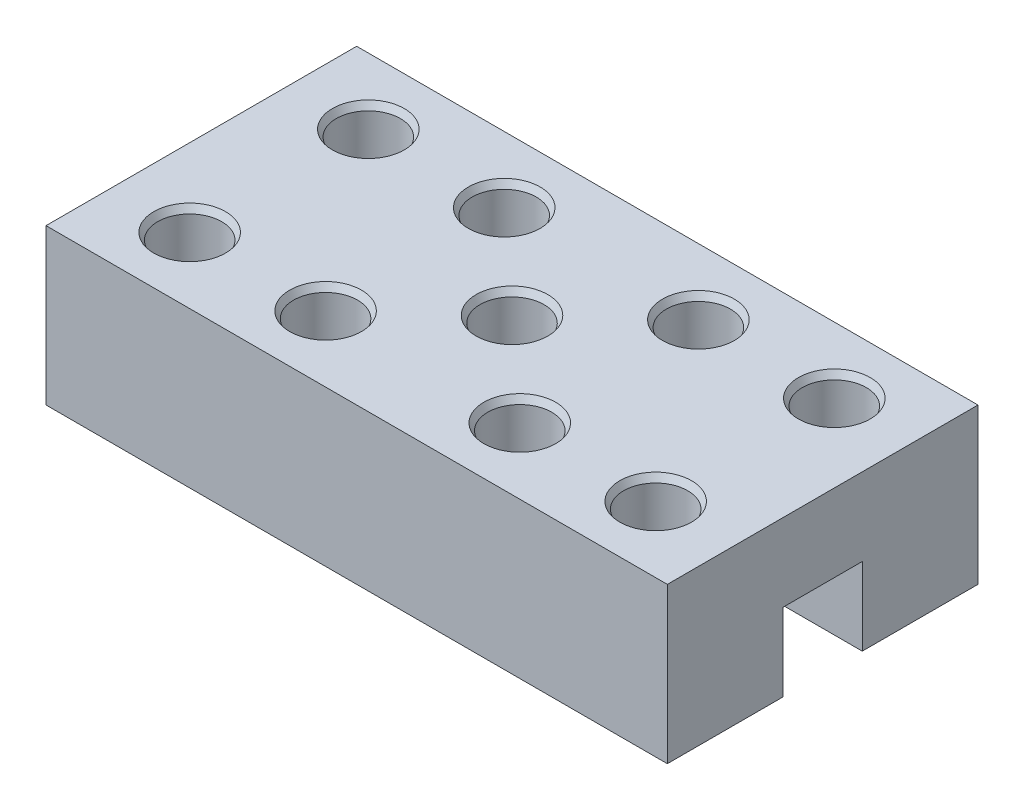
ISO-10303-21;
HEADER;
FILE_DESCRIPTION(('STEP AP214'),'2;1');
FILE_NAME('part.step','',(''),(''),'','','');
FILE_SCHEMA(('AUTOMOTIVE_DESIGN { 1 0 10303 214 1 1 1 1 }'));
ENDSEC;
DATA;
#1=APPLICATION_CONTEXT('core data for automotive mechanical design processes');
#2=APPLICATION_PROTOCOL_DEFINITION('international standard','automotive_design',2000,#1);
#3=PRODUCT_CONTEXT('',#1,'mechanical');
#4=PRODUCT('Part','Part','',(#3));
#5=PRODUCT_RELATED_PRODUCT_CATEGORY('part','',(#4));
#6=PRODUCT_DEFINITION_FORMATION('','',#4);
#7=PRODUCT_DEFINITION_CONTEXT('part definition',#1,'design');
#8=PRODUCT_DEFINITION('design','',#6,#7);
#9=PRODUCT_DEFINITION_SHAPE('','',#8);
#10=(LENGTH_UNIT() NAMED_UNIT(*) SI_UNIT(.MILLI.,.METRE.));
#11=(NAMED_UNIT(*) PLANE_ANGLE_UNIT() SI_UNIT($,.RADIAN.));
#12=(NAMED_UNIT(*) SI_UNIT($,.STERADIAN.) SOLID_ANGLE_UNIT());
#13=UNCERTAINTY_MEASURE_WITH_UNIT(LENGTH_MEASURE(1.E-05),#10,'distance_accuracy_value','');
#14=(GEOMETRIC_REPRESENTATION_CONTEXT(3) GLOBAL_UNCERTAINTY_ASSIGNED_CONTEXT((#13)) GLOBAL_UNIT_ASSIGNED_CONTEXT((#10,
#11,#12)) REPRESENTATION_CONTEXT('',''));
#15=CARTESIAN_POINT('',(0.,0.,0.));
#16=DIRECTION('',(0.,0.,1.));
#17=DIRECTION('',(1.,0.,0.));
#18=AXIS2_PLACEMENT_3D('',#15,#16,#17);
#19=CARTESIAN_POINT('',(0.,0.,0.));
#20=DIRECTION('',(0.,1.,0.));
#21=DIRECTION('',(0.,0.,1.));
#22=AXIS2_PLACEMENT_3D('',#19,#20,#21);
#23=PLANE('',#22);
#24=CARTESIAN_POINT('',(30.,0.,-11.5));
#25=DIRECTION('',(0.,1.,0.));
#26=DIRECTION('',(0.,0.,1.));
#27=AXIS2_PLACEMENT_3D('',#24,#25,#26);
#28=CIRCLE('',#27,4.125);
#29=CARTESIAN_POINT('',(30.,0.,-7.37500000000001));
#30=VERTEX_POINT('',#29);
#31=EDGE_CURVE('E345',#30,#30,#28,.T.);
#32=ORIENTED_EDGE('',*,*,#31,.T.);
#33=EDGE_LOOP('',(#32));
#34=FACE_BOUND('',#33,.T.);
#35=CARTESIAN_POINT('',(-30.,0.,-11.5));
#36=DIRECTION('',(0.,1.,0.));
#37=DIRECTION('',(0.,0.,1.));
#38=AXIS2_PLACEMENT_3D('',#35,#36,#37);
#39=CIRCLE('',#38,4.125);
#40=CARTESIAN_POINT('',(-30.,0.,-7.37500000000001));
#41=VERTEX_POINT('',#40);
#42=EDGE_CURVE('E340',#41,#41,#39,.T.);
#43=ORIENTED_EDGE('',*,*,#42,.T.);
#44=EDGE_LOOP('',(#43));
#45=FACE_BOUND('',#44,.T.);
#46=CARTESIAN_POINT('',(12.5,0.,-11.5));
#47=DIRECTION('',(0.,1.,0.));
#48=DIRECTION('',(0.,0.,1.));
#49=AXIS2_PLACEMENT_3D('',#46,#47,#48);
#50=CIRCLE('',#49,4.125);
#51=CARTESIAN_POINT('',(12.5,0.,-7.375));
#52=VERTEX_POINT('',#51);
#53=EDGE_CURVE('E342',#52,#52,#50,.T.);
#54=ORIENTED_EDGE('',*,*,#53,.T.);
#55=EDGE_LOOP('',(#54));
#56=FACE_BOUND('',#55,.T.);
#57=CARTESIAN_POINT('',(-12.5,0.,-11.5));
#58=DIRECTION('',(0.,1.,0.));
#59=DIRECTION('',(0.,0.,1.));
#60=AXIS2_PLACEMENT_3D('',#57,#58,#59);
#61=CIRCLE('',#60,4.125);
#62=CARTESIAN_POINT('',(-12.5,0.,-7.375));
#63=VERTEX_POINT('',#62);
#64=EDGE_CURVE('E350',#63,#63,#61,.T.);
#65=ORIENTED_EDGE('',*,*,#64,.T.);
#66=EDGE_LOOP('',(#65));
#67=FACE_BOUND('',#66,.T.);
#68=DIRECTION('',(0.,0.,-1.));
#69=VECTOR('',#68,1.);
#70=CARTESIAN_POINT('',(40.,0.,20.));
#71=LINE('',#70,#69);
#72=CARTESIAN_POINT('',(40.,0.,-5.1));
#73=VERTEX_POINT('',#72);
#74=CARTESIAN_POINT('',(40.,0.,-20.));
#75=VERTEX_POINT('',#74);
#76=EDGE_CURVE('E162',#73,#75,#71,.T.);
#77=ORIENTED_EDGE('',*,*,#76,.F.);
#78=DIRECTION('',(-1.,0.,0.));
#79=VECTOR('',#78,1.);
#80=CARTESIAN_POINT('',(0.,0.,-5.1));
#81=LINE('',#80,#79);
#82=CARTESIAN_POINT('',(-40.,0.,-5.1));
#83=VERTEX_POINT('',#82);
#84=EDGE_CURVE('E174',#73,#83,#81,.T.);
#85=ORIENTED_EDGE('',*,*,#84,.T.);
#86=DIRECTION('',(0.,0.,1.));
#87=VECTOR('',#86,1.);
#88=CARTESIAN_POINT('',(-40.,0.,20.));
#89=LINE('',#88,#87);
#90=CARTESIAN_POINT('',(-40.,0.,-20.));
#91=VERTEX_POINT('',#90);
#92=EDGE_CURVE('E157',#91,#83,#89,.T.);
#93=ORIENTED_EDGE('',*,*,#92,.F.);
#94=DIRECTION('',(-1.,0.,0.));
#95=VECTOR('',#94,1.);
#96=CARTESIAN_POINT('',(40.,0.,-20.));
#97=LINE('',#96,#95);
#98=EDGE_CURVE('E86',#75,#91,#97,.T.);
#99=ORIENTED_EDGE('',*,*,#98,.F.);
#100=EDGE_LOOP('',(#77,#85,#93,#99));
#101=FACE_BOUND('',#100,.T.);
#102=ADVANCED_FACE('F41',(#34,#45,#56,#67,#101),#23,.F.);
#103=CARTESIAN_POINT('',(-40.,20.,20.));
#104=DIRECTION('',(1.,0.,0.));
#105=DIRECTION('',(0.,0.,-1.));
#106=AXIS2_PLACEMENT_3D('',#103,#104,#105);
#107=PLANE('',#106);
#108=ORIENTED_EDGE('',*,*,#92,.T.);
#109=DIRECTION('',(0.,-1.,0.));
#110=VECTOR('',#109,1.);
#111=CARTESIAN_POINT('',(-40.,-10.,-5.1));
#112=LINE('',#111,#110);
#113=CARTESIAN_POINT('',(-40.,10.,-5.1));
#114=VERTEX_POINT('',#113);
#115=EDGE_CURVE('E142',#114,#83,#112,.T.);
#116=ORIENTED_EDGE('',*,*,#115,.F.);
#117=DIRECTION('',(0.,0.,-1.));
#118=VECTOR('',#117,1.);
#119=CARTESIAN_POINT('',(-40.,10.,5.1));
#120=LINE('',#119,#118);
#121=CARTESIAN_POINT('',(-40.,10.,5.1));
#122=VERTEX_POINT('',#121);
#123=EDGE_CURVE('E138',#122,#114,#120,.T.);
#124=ORIENTED_EDGE('',*,*,#123,.F.);
#125=DIRECTION('',(0.,1.,0.));
#126=VECTOR('',#125,1.);
#127=CARTESIAN_POINT('',(-40.,-10.,5.1));
#128=LINE('',#127,#126);
#129=CARTESIAN_POINT('',(-40.,0.,5.1));
#130=VERTEX_POINT('',#129);
#131=EDGE_CURVE('E118',#130,#122,#128,.T.);
#132=ORIENTED_EDGE('',*,*,#131,.F.);
#133=CARTESIAN_POINT('',(-40.,0.,20.));
#134=VERTEX_POINT('',#133);
#135=EDGE_CURVE('E147',#130,#134,#89,.T.);
#136=ORIENTED_EDGE('',*,*,#135,.T.);
#137=DIRECTION('',(0.,-1.,0.));
#138=VECTOR('',#137,1.);
#139=CARTESIAN_POINT('',(-40.,20.,20.));
#140=LINE('',#139,#138);
#141=CARTESIAN_POINT('',(-40.,20.,20.));
#142=VERTEX_POINT('',#141);
#143=EDGE_CURVE('E170',#142,#134,#140,.T.);
#144=ORIENTED_EDGE('',*,*,#143,.F.);
#145=DIRECTION('',(0.,0.,1.));
#146=VECTOR('',#145,1.);
#147=CARTESIAN_POINT('',(-40.,20.,20.));
#148=LINE('',#147,#146);
#149=CARTESIAN_POINT('',(-40.,20.,-20.));
#150=VERTEX_POINT('',#149);
#151=EDGE_CURVE('E149',#150,#142,#148,.T.);
#152=ORIENTED_EDGE('',*,*,#151,.F.);
#153=DIRECTION('',(0.,-1.,0.));
#154=VECTOR('',#153,1.);
#155=CARTESIAN_POINT('',(-40.,20.,-20.));
#156=LINE('',#155,#154);
#157=EDGE_CURVE('E156',#150,#91,#156,.T.);
#158=ORIENTED_EDGE('',*,*,#157,.T.);
#159=EDGE_LOOP('',(#108,#116,#124,#132,#136,#144,#152,#158));
#160=FACE_BOUND('',#159,.T.);
#161=ADVANCED_FACE('F248',(#160),#107,.F.);
#162=CARTESIAN_POINT('',(40.,20.,20.));
#163=DIRECTION('',(0.,0.,-1.));
#164=DIRECTION('',(-1.,0.,0.));
#165=AXIS2_PLACEMENT_3D('',#162,#163,#164);
#166=PLANE('',#165);
#167=DIRECTION('',(1.,0.,0.));
#168=VECTOR('',#167,1.);
#169=CARTESIAN_POINT('',(40.,0.,20.));
#170=LINE('',#169,#168);
#171=CARTESIAN_POINT('',(40.,0.,20.));
#172=VERTEX_POINT('',#171);
#173=EDGE_CURVE('E160',#134,#172,#170,.T.);
#174=ORIENTED_EDGE('',*,*,#173,.T.);
#175=DIRECTION('',(0.,-1.,0.));
#176=VECTOR('',#175,1.);
#177=CARTESIAN_POINT('',(40.,20.,20.));
#178=LINE('',#177,#176);
#179=CARTESIAN_POINT('',(40.,20.,20.));
#180=VERTEX_POINT('',#179);
#181=EDGE_CURVE('E168',#180,#172,#178,.T.);
#182=ORIENTED_EDGE('',*,*,#181,.F.);
#183=DIRECTION('',(1.,0.,0.));
#184=VECTOR('',#183,1.);
#185=CARTESIAN_POINT('',(40.,20.,20.));
#186=LINE('',#185,#184);
#187=EDGE_CURVE('E94',#142,#180,#186,.T.);
#188=ORIENTED_EDGE('',*,*,#187,.F.);
#189=ORIENTED_EDGE('',*,*,#143,.T.);
#190=EDGE_LOOP('',(#174,#182,#188,#189));
#191=FACE_BOUND('',#190,.T.);
#192=ADVANCED_FACE('F255',(#191),#166,.F.);
#193=CARTESIAN_POINT('',(40.,20.,20.));
#194=DIRECTION('',(-1.,0.,0.));
#195=DIRECTION('',(0.,0.,1.));
#196=AXIS2_PLACEMENT_3D('',#193,#194,#195);
#197=PLANE('',#196);
#198=DIRECTION('',(0.,0.,-1.));
#199=VECTOR('',#198,1.);
#200=CARTESIAN_POINT('',(40.,10.,5.1));
#201=LINE('',#200,#199);
#202=CARTESIAN_POINT('',(40.,10.,5.1));
#203=VERTEX_POINT('',#202);
#204=CARTESIAN_POINT('',(40.,10.,-5.1));
#205=VERTEX_POINT('',#204);
#206=EDGE_CURVE('E123',#203,#205,#201,.T.);
#207=ORIENTED_EDGE('',*,*,#206,.T.);
#208=DIRECTION('',(0.,-1.,0.));
#209=VECTOR('',#208,1.);
#210=CARTESIAN_POINT('',(40.,-10.,-5.1));
#211=LINE('',#210,#209);
#212=EDGE_CURVE('E136',#205,#73,#211,.T.);
#213=ORIENTED_EDGE('',*,*,#212,.T.);
#214=ORIENTED_EDGE('',*,*,#76,.T.);
#215=DIRECTION('',(0.,-1.,0.));
#216=VECTOR('',#215,1.);
#217=CARTESIAN_POINT('',(40.,20.,-20.));
#218=LINE('',#217,#216);
#219=CARTESIAN_POINT('',(40.,20.,-20.));
#220=VERTEX_POINT('',#219);
#221=EDGE_CURVE('E166',#220,#75,#218,.T.);
#222=ORIENTED_EDGE('',*,*,#221,.F.);
#223=DIRECTION('',(0.,0.,-1.));
#224=VECTOR('',#223,1.);
#225=CARTESIAN_POINT('',(40.,20.,20.));
#226=LINE('',#225,#224);
#227=EDGE_CURVE('E153',#180,#220,#226,.T.);
#228=ORIENTED_EDGE('',*,*,#227,.F.);
#229=ORIENTED_EDGE('',*,*,#181,.T.);
#230=CARTESIAN_POINT('',(40.,0.,5.1));
#231=VERTEX_POINT('',#230);
#232=EDGE_CURVE('E135',#172,#231,#71,.T.);
#233=ORIENTED_EDGE('',*,*,#232,.T.);
#234=DIRECTION('',(0.,1.,0.));
#235=VECTOR('',#234,1.);
#236=CARTESIAN_POINT('',(40.,-10.,5.1));
#237=LINE('',#236,#235);
#238=EDGE_CURVE('E56',#231,#203,#237,.T.);
#239=ORIENTED_EDGE('',*,*,#238,.T.);
#240=EDGE_LOOP('',(#207,#213,#214,#222,#228,#229,#233,#239));
#241=FACE_BOUND('',#240,.T.);
#242=ADVANCED_FACE('F132',(#241),#197,.F.);
#243=CARTESIAN_POINT('',(40.,20.,-20.));
#244=DIRECTION('',(0.,0.,1.));
#245=DIRECTION('',(1.,0.,0.));
#246=AXIS2_PLACEMENT_3D('',#243,#244,#245);
#247=PLANE('',#246);
#248=ORIENTED_EDGE('',*,*,#98,.T.);
#249=ORIENTED_EDGE('',*,*,#157,.F.);
#250=DIRECTION('',(-1.,0.,0.));
#251=VECTOR('',#250,1.);
#252=CARTESIAN_POINT('',(40.,20.,-20.));
#253=LINE('',#252,#251);
#254=EDGE_CURVE('E65',#220,#150,#253,.T.);
#255=ORIENTED_EDGE('',*,*,#254,.F.);
#256=ORIENTED_EDGE('',*,*,#221,.T.);
#257=EDGE_LOOP('',(#248,#249,#255,#256));
#258=FACE_BOUND('',#257,.T.);
#259=ADVANCED_FACE('F272',(#258),#247,.F.);
#260=CARTESIAN_POINT('',(0.,20.,0.));
#261=DIRECTION('',(0.,1.,0.));
#262=DIRECTION('',(0.,0.,1.));
#263=AXIS2_PLACEMENT_3D('',#260,#261,#262);
#264=PLANE('',#263);
#265=CARTESIAN_POINT('',(30.,20.,-11.5));
#266=DIRECTION('',(0.,1.,0.));
#267=DIRECTION('',(0.,0.,1.));
#268=AXIS2_PLACEMENT_3D('',#265,#266,#267);
#269=CIRCLE('',#268,4.62500000000003);
#270=CARTESIAN_POINT('',(30.,20.,-6.87499999999998));
#271=VERTEX_POINT('',#270);
#272=EDGE_CURVE('E208',#271,#271,#269,.F.);
#273=ORIENTED_EDGE('',*,*,#272,.T.);
#274=EDGE_LOOP('',(#273));
#275=FACE_BOUND('',#274,.T.);
#276=CARTESIAN_POINT('',(12.5,20.,-11.5));
#277=DIRECTION('',(0.,1.,0.));
#278=DIRECTION('',(0.,0.,1.));
#279=AXIS2_PLACEMENT_3D('',#276,#277,#278);
#280=CIRCLE('',#279,4.62500000000003);
#281=CARTESIAN_POINT('',(12.5,20.,-6.87499999999998));
#282=VERTEX_POINT('',#281);
#283=EDGE_CURVE('E205',#282,#282,#280,.F.);
#284=ORIENTED_EDGE('',*,*,#283,.T.);
#285=EDGE_LOOP('',(#284));
#286=FACE_BOUND('',#285,.T.);
#287=CARTESIAN_POINT('',(0.,20.,0.));
#288=DIRECTION('',(0.,1.,0.));
#289=DIRECTION('',(0.,0.,1.));
#290=AXIS2_PLACEMENT_3D('',#287,#288,#289);
#291=CIRCLE('',#290,4.62500000000002);
#292=CARTESIAN_POINT('',(0.,20.,4.62500000000002));
#293=VERTEX_POINT('',#292);
#294=EDGE_CURVE('E202',#293,#293,#291,.F.);
#295=ORIENTED_EDGE('',*,*,#294,.T.);
#296=EDGE_LOOP('',(#295));
#297=FACE_BOUND('',#296,.T.);
#298=CARTESIAN_POINT('',(-12.5,20.,-11.5));
#299=DIRECTION('',(0.,1.,0.));
#300=DIRECTION('',(0.,0.,1.));
#301=AXIS2_PLACEMENT_3D('',#298,#299,#300);
#302=CIRCLE('',#301,4.625);
#303=CARTESIAN_POINT('',(-12.5,20.,-6.875));
#304=VERTEX_POINT('',#303);
#305=EDGE_CURVE('E199',#304,#304,#302,.F.);
#306=ORIENTED_EDGE('',*,*,#305,.T.);
#307=EDGE_LOOP('',(#306));
#308=FACE_BOUND('',#307,.T.);
#309=CARTESIAN_POINT('',(-30.,20.,-11.5));
#310=DIRECTION('',(0.,1.,0.));
#311=DIRECTION('',(0.,0.,1.));
#312=AXIS2_PLACEMENT_3D('',#309,#310,#311);
#313=CIRCLE('',#312,4.62500000000003);
#314=CARTESIAN_POINT('',(-30.,20.,-6.87499999999998));
#315=VERTEX_POINT('',#314);
#316=EDGE_CURVE('E196',#315,#315,#313,.F.);
#317=ORIENTED_EDGE('',*,*,#316,.T.);
#318=EDGE_LOOP('',(#317));
#319=FACE_BOUND('',#318,.T.);
#320=CARTESIAN_POINT('',(-30.,20.,11.5));
#321=DIRECTION('',(0.,1.,0.));
#322=DIRECTION('',(0.,0.,1.));
#323=AXIS2_PLACEMENT_3D('',#320,#321,#322);
#324=CIRCLE('',#323,4.625);
#325=CARTESIAN_POINT('',(-30.,20.,16.125));
#326=VERTEX_POINT('',#325);
#327=EDGE_CURVE('E193',#326,#326,#324,.F.);
#328=ORIENTED_EDGE('',*,*,#327,.T.);
#329=EDGE_LOOP('',(#328));
#330=FACE_BOUND('',#329,.T.);
#331=CARTESIAN_POINT('',(-12.5,20.,11.5));
#332=DIRECTION('',(0.,1.,0.));
#333=DIRECTION('',(0.,0.,1.));
#334=AXIS2_PLACEMENT_3D('',#331,#332,#333);
#335=CIRCLE('',#334,4.625);
#336=CARTESIAN_POINT('',(-12.5,20.,16.125));
#337=VERTEX_POINT('',#336);
#338=EDGE_CURVE('E190',#337,#337,#335,.F.);
#339=ORIENTED_EDGE('',*,*,#338,.T.);
#340=EDGE_LOOP('',(#339));
#341=FACE_BOUND('',#340,.T.);
#342=CARTESIAN_POINT('',(12.5,20.,11.5));
#343=DIRECTION('',(0.,1.,0.));
#344=DIRECTION('',(0.,0.,1.));
#345=AXIS2_PLACEMENT_3D('',#342,#343,#344);
#346=CIRCLE('',#345,4.625);
#347=CARTESIAN_POINT('',(12.5,20.,16.125));
#348=VERTEX_POINT('',#347);
#349=EDGE_CURVE('E187',#348,#348,#346,.F.);
#350=ORIENTED_EDGE('',*,*,#349,.T.);
#351=EDGE_LOOP('',(#350));
#352=FACE_BOUND('',#351,.T.);
#353=CARTESIAN_POINT('',(30.,20.,11.5));
#354=DIRECTION('',(0.,1.,0.));
#355=DIRECTION('',(0.,0.,1.));
#356=AXIS2_PLACEMENT_3D('',#353,#354,#355);
#357=CIRCLE('',#356,4.62500000000002);
#358=CARTESIAN_POINT('',(30.,20.,16.125));
#359=VERTEX_POINT('',#358);
#360=EDGE_CURVE('E184',#359,#359,#357,.F.);
#361=ORIENTED_EDGE('',*,*,#360,.T.);
#362=EDGE_LOOP('',(#361));
#363=FACE_BOUND('',#362,.T.);
#364=ORIENTED_EDGE('',*,*,#151,.T.);
#365=ORIENTED_EDGE('',*,*,#187,.T.);
#366=ORIENTED_EDGE('',*,*,#227,.T.);
#367=ORIENTED_EDGE('',*,*,#254,.T.);
#368=EDGE_LOOP('',(#364,#365,#366,#367));
#369=FACE_BOUND('',#368,.T.);
#370=ADVANCED_FACE('F264',(#275,#286,#297,#308,#319,#330,#341,#352,#363,#369),#264,.T.);
#371=CARTESIAN_POINT('',(-30.,0.,11.5));
#372=DIRECTION('',(0.,1.,0.));
#373=DIRECTION('',(0.,0.,1.));
#374=AXIS2_PLACEMENT_3D('',#371,#372,#373);
#375=CIRCLE('',#374,4.125);
#376=CARTESIAN_POINT('',(-30.,0.,15.625));
#377=VERTEX_POINT('',#376);
#378=EDGE_CURVE('E277',#377,#377,#375,.T.);
#379=ORIENTED_EDGE('',*,*,#378,.T.);
#380=EDGE_LOOP('',(#379));
#381=FACE_BOUND('',#380,.T.);
#382=CARTESIAN_POINT('',(30.,0.,11.5));
#383=DIRECTION('',(0.,1.,0.));
#384=DIRECTION('',(0.,0.,1.));
#385=AXIS2_PLACEMENT_3D('',#382,#383,#384);
#386=CIRCLE('',#385,4.12500000000001);
#387=CARTESIAN_POINT('',(30.,0.,15.625));
#388=VERTEX_POINT('',#387);
#389=EDGE_CURVE('E281',#388,#388,#386,.T.);
#390=ORIENTED_EDGE('',*,*,#389,.T.);
#391=EDGE_LOOP('',(#390));
#392=FACE_BOUND('',#391,.T.);
#393=CARTESIAN_POINT('',(-12.5,0.,11.5));
#394=DIRECTION('',(0.,1.,0.));
#395=DIRECTION('',(0.,0.,1.));
#396=AXIS2_PLACEMENT_3D('',#393,#394,#395);
#397=CIRCLE('',#396,4.125);
#398=CARTESIAN_POINT('',(-12.5,0.,15.625));
#399=VERTEX_POINT('',#398);
#400=EDGE_CURVE('E181',#399,#399,#397,.T.);
#401=ORIENTED_EDGE('',*,*,#400,.T.);
#402=EDGE_LOOP('',(#401));
#403=FACE_BOUND('',#402,.T.);
#404=CARTESIAN_POINT('',(12.5,0.,11.5));
#405=DIRECTION('',(0.,1.,0.));
#406=DIRECTION('',(0.,0.,1.));
#407=AXIS2_PLACEMENT_3D('',#404,#405,#406);
#408=CIRCLE('',#407,4.125);
#409=CARTESIAN_POINT('',(12.5,0.,15.625));
#410=VERTEX_POINT('',#409);
#411=EDGE_CURVE('E144',#410,#410,#408,.T.);
#412=ORIENTED_EDGE('',*,*,#411,.T.);
#413=EDGE_LOOP('',(#412));
#414=FACE_BOUND('',#413,.T.);
#415=ORIENTED_EDGE('',*,*,#135,.F.);
#416=DIRECTION('',(1.,0.,0.));
#417=VECTOR('',#416,1.);
#418=CARTESIAN_POINT('',(0.,0.,5.1));
#419=LINE('',#418,#417);
#420=EDGE_CURVE('E172',#130,#231,#419,.T.);
#421=ORIENTED_EDGE('',*,*,#420,.T.);
#422=ORIENTED_EDGE('',*,*,#232,.F.);
#423=ORIENTED_EDGE('',*,*,#173,.F.);
#424=EDGE_LOOP('',(#415,#421,#422,#423));
#425=FACE_BOUND('',#424,.T.);
#426=ADVANCED_FACE('F251',(#381,#392,#403,#414,#425),#23,.F.);
#427=CARTESIAN_POINT('',(40.,-10.,-5.1));
#428=DIRECTION('',(0.,0.,-1.));
#429=DIRECTION('',(-1.,0.,0.));
#430=AXIS2_PLACEMENT_3D('',#427,#428,#429);
#431=PLANE('',#430);
#432=ORIENTED_EDGE('',*,*,#212,.F.);
#433=DIRECTION('',(-1.,0.,0.));
#434=VECTOR('',#433,1.);
#435=CARTESIAN_POINT('',(40.,10.,-5.1));
#436=LINE('',#435,#434);
#437=EDGE_CURVE('E122',#205,#114,#436,.T.);
#438=ORIENTED_EDGE('',*,*,#437,.T.);
#439=ORIENTED_EDGE('',*,*,#115,.T.);
#440=ORIENTED_EDGE('',*,*,#84,.F.);
#441=EDGE_LOOP('',(#432,#438,#439,#440));
#442=FACE_BOUND('',#441,.T.);
#443=ADVANCED_FACE('F263',(#442),#431,.F.);
#444=CARTESIAN_POINT('',(40.,-10.,5.1));
#445=DIRECTION('',(0.,0.,1.));
#446=DIRECTION('',(1.,0.,0.));
#447=AXIS2_PLACEMENT_3D('',#444,#445,#446);
#448=PLANE('',#447);
#449=ORIENTED_EDGE('',*,*,#131,.T.);
#450=DIRECTION('',(-1.,0.,0.));
#451=VECTOR('',#450,1.);
#452=CARTESIAN_POINT('',(40.,10.,5.1));
#453=LINE('',#452,#451);
#454=EDGE_CURVE('E114',#203,#122,#453,.T.);
#455=ORIENTED_EDGE('',*,*,#454,.F.);
#456=ORIENTED_EDGE('',*,*,#238,.F.);
#457=ORIENTED_EDGE('',*,*,#420,.F.);
#458=EDGE_LOOP('',(#449,#455,#456,#457));
#459=FACE_BOUND('',#458,.T.);
#460=ADVANCED_FACE('F116',(#459),#448,.F.);
#461=CARTESIAN_POINT('',(40.,10.,5.1));
#462=DIRECTION('',(0.,1.,0.));
#463=DIRECTION('',(0.,0.,1.));
#464=AXIS2_PLACEMENT_3D('',#461,#462,#463);
#465=PLANE('',#464);
#466=CARTESIAN_POINT('',(0.,10.,0.));
#467=DIRECTION('',(0.,1.,0.));
#468=DIRECTION('',(0.,0.,1.));
#469=AXIS2_PLACEMENT_3D('',#466,#467,#468);
#470=CIRCLE('',#469,4.125);
#471=CARTESIAN_POINT('',(0.,10.,4.125));
#472=VERTEX_POINT('',#471);
#473=EDGE_CURVE('E178',#472,#472,#470,.T.);
#474=ORIENTED_EDGE('',*,*,#473,.T.);
#475=EDGE_LOOP('',(#474));
#476=FACE_BOUND('',#475,.T.);
#477=ORIENTED_EDGE('',*,*,#123,.T.);
#478=ORIENTED_EDGE('',*,*,#437,.F.);
#479=ORIENTED_EDGE('',*,*,#206,.F.);
#480=ORIENTED_EDGE('',*,*,#454,.T.);
#481=EDGE_LOOP('',(#477,#478,#479,#480));
#482=FACE_BOUND('',#481,.T.);
#483=ADVANCED_FACE('F126',(#476,#482),#465,.F.);
#484=CARTESIAN_POINT('',(12.5,0.,11.5));
#485=DIRECTION('',(0.,1.,0.));
#486=DIRECTION('',(0.,0.,1.));
#487=AXIS2_PLACEMENT_3D('',#484,#485,#486);
#488=CYLINDRICAL_SURFACE('',#487,4.125);
#489=CARTESIAN_POINT('',(12.5,19.1339745962156,11.5));
#490=DIRECTION('',(0.,1.,0.));
#491=DIRECTION('',(0.,0.,1.));
#492=AXIS2_PLACEMENT_3D('',#489,#490,#491);
#493=CIRCLE('',#492,4.125);
#494=CARTESIAN_POINT('',(12.5,19.1339745962156,15.625));
#495=VERTEX_POINT('',#494);
#496=EDGE_CURVE('E49',#495,#495,#493,.T.);
#497=ORIENTED_EDGE('',*,*,#496,.T.);
#498=EDGE_LOOP('',(#497));
#499=FACE_BOUND('',#498,.T.);
#500=ORIENTED_EDGE('',*,*,#411,.F.);
#501=EDGE_LOOP('',(#500));
#502=FACE_BOUND('',#501,.T.);
#503=ADVANCED_FACE('F231',(#499,#502),#488,.F.);
#504=CARTESIAN_POINT('',(0.,0.,0.));
#505=DIRECTION('',(0.,1.,0.));
#506=DIRECTION('',(0.,0.,1.));
#507=AXIS2_PLACEMENT_3D('',#504,#505,#506);
#508=CYLINDRICAL_SURFACE('',#507,4.125);
#509=CARTESIAN_POINT('',(0.,19.1339745962155,0.));
#510=DIRECTION('',(0.,1.,0.));
#511=DIRECTION('',(0.,0.,1.));
#512=AXIS2_PLACEMENT_3D('',#509,#510,#511);
#513=CIRCLE('',#512,4.125);
#514=CARTESIAN_POINT('',(0.,19.1339745962155,4.125));
#515=VERTEX_POINT('',#514);
#516=EDGE_CURVE('E214',#515,#515,#513,.T.);
#517=ORIENTED_EDGE('',*,*,#516,.T.);
#518=EDGE_LOOP('',(#517));
#519=FACE_BOUND('',#518,.T.);
#520=ORIENTED_EDGE('',*,*,#473,.F.);
#521=EDGE_LOOP('',(#520));
#522=FACE_BOUND('',#521,.T.);
#523=ADVANCED_FACE('F379',(#519,#522),#508,.F.);
#524=CARTESIAN_POINT('',(-12.5,0.,11.5));
#525=DIRECTION('',(0.,1.,0.));
#526=DIRECTION('',(0.,0.,1.));
#527=AXIS2_PLACEMENT_3D('',#524,#525,#526);
#528=CYLINDRICAL_SURFACE('',#527,4.125);
#529=CARTESIAN_POINT('',(-12.5,19.1339745962156,11.5));
#530=DIRECTION('',(0.,1.,0.));
#531=DIRECTION('',(0.,0.,1.));
#532=AXIS2_PLACEMENT_3D('',#529,#530,#531);
#533=CIRCLE('',#532,4.125);
#534=CARTESIAN_POINT('',(-12.5,19.1339745962156,15.625));
#535=VERTEX_POINT('',#534);
#536=EDGE_CURVE('E226',#535,#535,#533,.T.);
#537=ORIENTED_EDGE('',*,*,#536,.T.);
#538=EDGE_LOOP('',(#537));
#539=FACE_BOUND('',#538,.T.);
#540=ORIENTED_EDGE('',*,*,#400,.F.);
#541=EDGE_LOOP('',(#540));
#542=FACE_BOUND('',#541,.T.);
#543=ADVANCED_FACE('F375',(#539,#542),#528,.F.);
#544=CARTESIAN_POINT('',(30.,0.,11.5));
#545=DIRECTION('',(0.,1.,0.));
#546=DIRECTION('',(0.,0.,1.));
#547=AXIS2_PLACEMENT_3D('',#544,#545,#546);
#548=CYLINDRICAL_SURFACE('',#547,4.12500000000001);
#549=CARTESIAN_POINT('',(30.,19.1339745962155,11.5));
#550=DIRECTION('',(0.,1.,0.));
#551=DIRECTION('',(0.,0.,1.));
#552=AXIS2_PLACEMENT_3D('',#549,#550,#551);
#553=CIRCLE('',#552,4.12500000000001);
#554=CARTESIAN_POINT('',(30.,19.1339745962155,15.625));
#555=VERTEX_POINT('',#554);
#556=EDGE_CURVE('E11',#555,#555,#553,.T.);
#557=ORIENTED_EDGE('',*,*,#556,.T.);
#558=EDGE_LOOP('',(#557));
#559=FACE_BOUND('',#558,.T.);
#560=ORIENTED_EDGE('',*,*,#389,.F.);
#561=EDGE_LOOP('',(#560));
#562=FACE_BOUND('',#561,.T.);
#563=ADVANCED_FACE('F338',(#559,#562),#548,.F.);
#564=CARTESIAN_POINT('',(-30.,0.,11.5));
#565=DIRECTION('',(0.,1.,0.));
#566=DIRECTION('',(0.,0.,1.));
#567=AXIS2_PLACEMENT_3D('',#564,#565,#566);
#568=CYLINDRICAL_SURFACE('',#567,4.125);
#569=CARTESIAN_POINT('',(-30.,19.1339745962156,11.5));
#570=DIRECTION('',(0.,1.,0.));
#571=DIRECTION('',(0.,0.,1.));
#572=AXIS2_PLACEMENT_3D('',#569,#570,#571);
#573=CIRCLE('',#572,4.125);
#574=CARTESIAN_POINT('',(-30.,19.1339745962156,15.625));
#575=VERTEX_POINT('',#574);
#576=EDGE_CURVE('E223',#575,#575,#573,.T.);
#577=ORIENTED_EDGE('',*,*,#576,.T.);
#578=EDGE_LOOP('',(#577));
#579=FACE_BOUND('',#578,.T.);
#580=ORIENTED_EDGE('',*,*,#378,.F.);
#581=EDGE_LOOP('',(#580));
#582=FACE_BOUND('',#581,.T.);
#583=ADVANCED_FACE('F334',(#579,#582),#568,.F.);
#584=CARTESIAN_POINT('',(-12.5,0.,-11.5));
#585=DIRECTION('',(0.,1.,0.));
#586=DIRECTION('',(0.,0.,1.));
#587=AXIS2_PLACEMENT_3D('',#584,#585,#586);
#588=CYLINDRICAL_SURFACE('',#587,4.125);
#589=CARTESIAN_POINT('',(-12.5,19.1339745962156,-11.5));
#590=DIRECTION('',(0.,1.,0.));
#591=DIRECTION('',(0.,0.,1.));
#592=AXIS2_PLACEMENT_3D('',#589,#590,#591);
#593=CIRCLE('',#592,4.125);
#594=CARTESIAN_POINT('',(-12.5,19.1339745962156,-7.375));
#595=VERTEX_POINT('',#594);
#596=EDGE_CURVE('E217',#595,#595,#593,.T.);
#597=ORIENTED_EDGE('',*,*,#596,.T.);
#598=EDGE_LOOP('',(#597));
#599=FACE_BOUND('',#598,.T.);
#600=ORIENTED_EDGE('',*,*,#64,.F.);
#601=EDGE_LOOP('',(#600));
#602=FACE_BOUND('',#601,.T.);
#603=ADVANCED_FACE('F337',(#599,#602),#588,.F.);
#604=CARTESIAN_POINT('',(12.5,0.,-11.5));
#605=DIRECTION('',(0.,1.,0.));
#606=DIRECTION('',(0.,0.,1.));
#607=AXIS2_PLACEMENT_3D('',#604,#605,#606);
#608=CYLINDRICAL_SURFACE('',#607,4.125);
#609=CARTESIAN_POINT('',(12.5,19.1339745962155,-11.5));
#610=DIRECTION('',(0.,1.,0.));
#611=DIRECTION('',(0.,0.,1.));
#612=AXIS2_PLACEMENT_3D('',#609,#610,#611);
#613=CIRCLE('',#612,4.125);
#614=CARTESIAN_POINT('',(12.5,19.1339745962155,-7.375));
#615=VERTEX_POINT('',#614);
#616=EDGE_CURVE('E211',#615,#615,#613,.T.);
#617=ORIENTED_EDGE('',*,*,#616,.T.);
#618=EDGE_LOOP('',(#617));
#619=FACE_BOUND('',#618,.T.);
#620=ORIENTED_EDGE('',*,*,#53,.F.);
#621=EDGE_LOOP('',(#620));
#622=FACE_BOUND('',#621,.T.);
#623=ADVANCED_FACE('F358',(#619,#622),#608,.F.);
#624=CARTESIAN_POINT('',(-30.,0.,-11.5));
#625=DIRECTION('',(0.,1.,0.));
#626=DIRECTION('',(0.,0.,1.));
#627=AXIS2_PLACEMENT_3D('',#624,#625,#626);
#628=CYLINDRICAL_SURFACE('',#627,4.125);
#629=CARTESIAN_POINT('',(-30.,19.1339745962155,-11.5));
#630=DIRECTION('',(0.,1.,0.));
#631=DIRECTION('',(0.,0.,1.));
#632=AXIS2_PLACEMENT_3D('',#629,#630,#631);
#633=CIRCLE('',#632,4.125);
#634=CARTESIAN_POINT('',(-30.,19.1339745962155,-7.37500000000001));
#635=VERTEX_POINT('',#634);
#636=EDGE_CURVE('E220',#635,#635,#633,.T.);
#637=ORIENTED_EDGE('',*,*,#636,.T.);
#638=EDGE_LOOP('',(#637));
#639=FACE_BOUND('',#638,.T.);
#640=ORIENTED_EDGE('',*,*,#42,.F.);
#641=EDGE_LOOP('',(#640));
#642=FACE_BOUND('',#641,.T.);
#643=ADVANCED_FACE('F360',(#639,#642),#628,.F.);
#644=CARTESIAN_POINT('',(30.,0.,-11.5));
#645=DIRECTION('',(0.,1.,0.));
#646=DIRECTION('',(0.,0.,1.));
#647=AXIS2_PLACEMENT_3D('',#644,#645,#646);
#648=CYLINDRICAL_SURFACE('',#647,4.125);
#649=CARTESIAN_POINT('',(30.,19.1339745962155,-11.5));
#650=DIRECTION('',(0.,1.,0.));
#651=DIRECTION('',(0.,0.,1.));
#652=AXIS2_PLACEMENT_3D('',#649,#650,#651);
#653=CIRCLE('',#652,4.125);
#654=CARTESIAN_POINT('',(30.,19.1339745962155,-7.37500000000001));
#655=VERTEX_POINT('',#654);
#656=EDGE_CURVE('E177',#655,#655,#653,.T.);
#657=ORIENTED_EDGE('',*,*,#656,.T.);
#658=EDGE_LOOP('',(#657));
#659=FACE_BOUND('',#658,.T.);
#660=ORIENTED_EDGE('',*,*,#31,.F.);
#661=EDGE_LOOP('',(#660));
#662=FACE_BOUND('',#661,.T.);
#663=ADVANCED_FACE('F309',(#659,#662),#648,.F.);
#664=CARTESIAN_POINT('',(30.,19.1339745962155,-11.5));
#665=DIRECTION('',(0.,1.,0.));
#666=DIRECTION('',(0.,0.,1.));
#667=AXIS2_PLACEMENT_3D('',#664,#665,#666);
#668=CONICAL_SURFACE('',#667,4.125,0.523598775598306);
#669=ORIENTED_EDGE('',*,*,#272,.F.);
#670=EDGE_LOOP('',(#669));
#671=FACE_BOUND('',#670,.T.);
#672=ORIENTED_EDGE('',*,*,#656,.F.);
#673=EDGE_LOOP('',(#672));
#674=FACE_BOUND('',#673,.T.);
#675=ADVANCED_FACE('F305',(#671,#674),#668,.F.);
#676=CARTESIAN_POINT('',(12.5,19.1339745962155,-11.5));
#677=DIRECTION('',(0.,1.,0.));
#678=DIRECTION('',(0.,0.,1.));
#679=AXIS2_PLACEMENT_3D('',#676,#677,#678);
#680=CONICAL_SURFACE('',#679,4.125,0.523598775598306);
#681=ORIENTED_EDGE('',*,*,#283,.F.);
#682=EDGE_LOOP('',(#681));
#683=FACE_BOUND('',#682,.T.);
#684=ORIENTED_EDGE('',*,*,#616,.F.);
#685=EDGE_LOOP('',(#684));
#686=FACE_BOUND('',#685,.T.);
#687=ADVANCED_FACE('F308',(#683,#686),#680,.F.);
#688=CARTESIAN_POINT('',(0.,19.1339745962155,0.));
#689=DIRECTION('',(0.,1.,0.));
#690=DIRECTION('',(0.,0.,1.));
#691=AXIS2_PLACEMENT_3D('',#688,#689,#690);
#692=CONICAL_SURFACE('',#691,4.125,0.523598775598304);
#693=ORIENTED_EDGE('',*,*,#294,.F.);
#694=EDGE_LOOP('',(#693));
#695=FACE_BOUND('',#694,.T.);
#696=ORIENTED_EDGE('',*,*,#516,.F.);
#697=EDGE_LOOP('',(#696));
#698=FACE_BOUND('',#697,.T.);
#699=ADVANCED_FACE('F313',(#695,#698),#692,.F.);
#700=CARTESIAN_POINT('',(-12.5,19.1339745962156,-11.5));
#701=DIRECTION('',(0.,1.,0.));
#702=DIRECTION('',(0.,0.,1.));
#703=AXIS2_PLACEMENT_3D('',#700,#701,#702);
#704=CONICAL_SURFACE('',#703,4.125,0.523598775598303);
#705=ORIENTED_EDGE('',*,*,#305,.F.);
#706=EDGE_LOOP('',(#705));
#707=FACE_BOUND('',#706,.T.);
#708=ORIENTED_EDGE('',*,*,#596,.F.);
#709=EDGE_LOOP('',(#708));
#710=FACE_BOUND('',#709,.T.);
#711=ADVANCED_FACE('F317',(#707,#710),#704,.F.);
#712=CARTESIAN_POINT('',(-30.,19.1339745962155,-11.5));
#713=DIRECTION('',(0.,1.,0.));
#714=DIRECTION('',(0.,0.,1.));
#715=AXIS2_PLACEMENT_3D('',#712,#713,#714);
#716=CONICAL_SURFACE('',#715,4.125,0.523598775598306);
#717=ORIENTED_EDGE('',*,*,#316,.F.);
#718=EDGE_LOOP('',(#717));
#719=FACE_BOUND('',#718,.T.);
#720=ORIENTED_EDGE('',*,*,#636,.F.);
#721=EDGE_LOOP('',(#720));
#722=FACE_BOUND('',#721,.T.);
#723=ADVANCED_FACE('F321',(#719,#722),#716,.F.);
#724=CARTESIAN_POINT('',(-30.,19.1339745962156,11.5));
#725=DIRECTION('',(0.,1.,0.));
#726=DIRECTION('',(0.,0.,1.));
#727=AXIS2_PLACEMENT_3D('',#724,#725,#726);
#728=CONICAL_SURFACE('',#727,4.125,0.523598775598303);
#729=ORIENTED_EDGE('',*,*,#327,.F.);
#730=EDGE_LOOP('',(#729));
#731=FACE_BOUND('',#730,.T.);
#732=ORIENTED_EDGE('',*,*,#576,.F.);
#733=EDGE_LOOP('',(#732));
#734=FACE_BOUND('',#733,.T.);
#735=ADVANCED_FACE('F243',(#731,#734),#728,.F.);
#736=CARTESIAN_POINT('',(-12.5,19.1339745962156,11.5));
#737=DIRECTION('',(0.,1.,0.));
#738=DIRECTION('',(0.,0.,1.));
#739=AXIS2_PLACEMENT_3D('',#736,#737,#738);
#740=CONICAL_SURFACE('',#739,4.125,0.523598775598301);
#741=ORIENTED_EDGE('',*,*,#338,.F.);
#742=EDGE_LOOP('',(#741));
#743=FACE_BOUND('',#742,.T.);
#744=ORIENTED_EDGE('',*,*,#536,.F.);
#745=EDGE_LOOP('',(#744));
#746=FACE_BOUND('',#745,.T.);
#747=ADVANCED_FACE('F236',(#743,#746),#740,.F.);
#748=CARTESIAN_POINT('',(12.5,19.1339745962156,11.5));
#749=DIRECTION('',(0.,1.,0.));
#750=DIRECTION('',(0.,0.,1.));
#751=AXIS2_PLACEMENT_3D('',#748,#749,#750);
#752=CONICAL_SURFACE('',#751,4.125,0.523598775598301);
#753=ORIENTED_EDGE('',*,*,#349,.F.);
#754=EDGE_LOOP('',(#753));
#755=FACE_BOUND('',#754,.T.);
#756=ORIENTED_EDGE('',*,*,#496,.F.);
#757=EDGE_LOOP('',(#756));
#758=FACE_BOUND('',#757,.T.);
#759=ADVANCED_FACE('F234',(#755,#758),#752,.F.);
#760=CARTESIAN_POINT('',(30.,19.1339745962155,11.5));
#761=DIRECTION('',(0.,1.,0.));
#762=DIRECTION('',(0.,0.,1.));
#763=AXIS2_PLACEMENT_3D('',#760,#761,#762);
#764=CONICAL_SURFACE('',#763,4.12500000000001,0.523598775598304);
#765=ORIENTED_EDGE('',*,*,#360,.F.);
#766=EDGE_LOOP('',(#765));
#767=FACE_BOUND('',#766,.T.);
#768=ORIENTED_EDGE('',*,*,#556,.F.);
#769=EDGE_LOOP('',(#768));
#770=FACE_BOUND('',#769,.T.);
#771=ADVANCED_FACE('F43',(#767,#770),#764,.F.);
#772=CLOSED_SHELL('',(#102,#161,#192,#242,#259,#370,#426,#443,#460,#483,#503,#523,#543,#563,
#583,#603,#623,#643,#663,#675,#687,#699,#711,#723,#735,#747,#759,#771));
#773=MANIFOLD_SOLID_BREP('B2',#772);
#774=ADVANCED_BREP_SHAPE_REPRESENTATION('',(#18,#773),#14);
#775=SHAPE_DEFINITION_REPRESENTATION(#9,#774);
ENDSEC;
END-ISO-10303-21;
